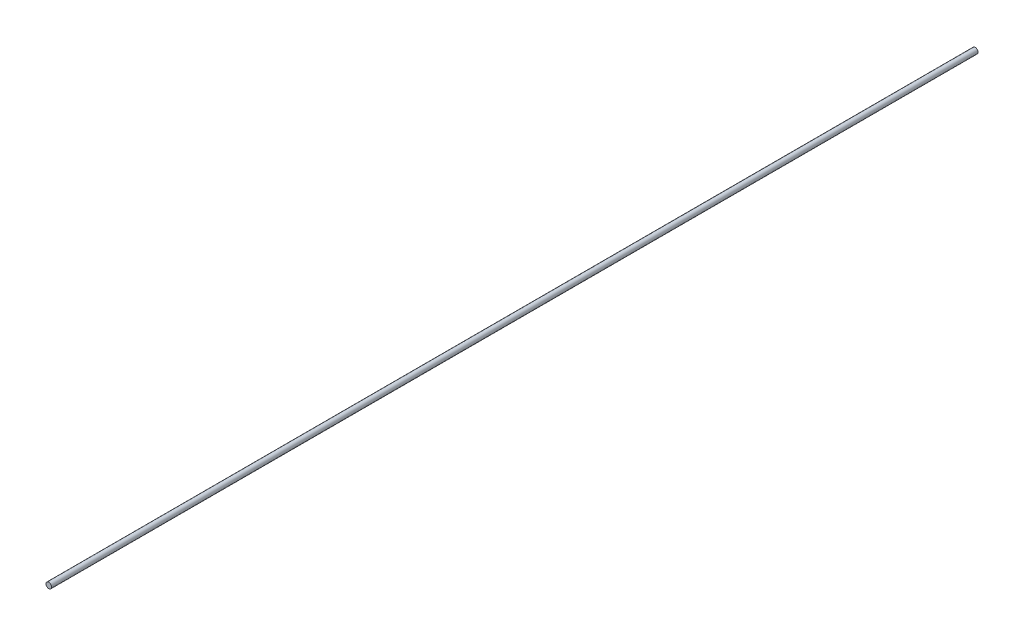
ISO-10303-21;
HEADER;
FILE_DESCRIPTION(('STEP AP214'),'2;1');
FILE_NAME('part.step','',(''),(''),'','','');
FILE_SCHEMA(('AUTOMOTIVE_DESIGN { 1 0 10303 214 1 1 1 1 }'));
ENDSEC;
DATA;
#1=APPLICATION_CONTEXT('core data for automotive mechanical design processes');
#2=APPLICATION_PROTOCOL_DEFINITION('international standard','automotive_design',2000,#1);
#3=PRODUCT_CONTEXT('',#1,'mechanical');
#4=PRODUCT('Part','Part','',(#3));
#5=PRODUCT_RELATED_PRODUCT_CATEGORY('part','',(#4));
#6=PRODUCT_DEFINITION_FORMATION('','',#4);
#7=PRODUCT_DEFINITION_CONTEXT('part definition',#1,'design');
#8=PRODUCT_DEFINITION('design','',#6,#7);
#9=PRODUCT_DEFINITION_SHAPE('','',#8);
#10=(LENGTH_UNIT() NAMED_UNIT(*) SI_UNIT(.MILLI.,.METRE.));
#11=(NAMED_UNIT(*) PLANE_ANGLE_UNIT() SI_UNIT($,.RADIAN.));
#12=(NAMED_UNIT(*) SI_UNIT($,.STERADIAN.) SOLID_ANGLE_UNIT());
#13=UNCERTAINTY_MEASURE_WITH_UNIT(LENGTH_MEASURE(1.E-05),#10,'distance_accuracy_value','');
#14=(GEOMETRIC_REPRESENTATION_CONTEXT(3) GLOBAL_UNCERTAINTY_ASSIGNED_CONTEXT((#13)) GLOBAL_UNIT_ASSIGNED_CONTEXT((#10,
#11,#12)) REPRESENTATION_CONTEXT('',''));
#15=CARTESIAN_POINT('',(0.,0.,0.));
#16=DIRECTION('',(0.,0.,1.));
#17=DIRECTION('',(1.,0.,0.));
#18=AXIS2_PLACEMENT_3D('',#15,#16,#17);
#19=CARTESIAN_POINT('',(0.,0.,160.));
#20=DIRECTION('',(0.,0.,-1.));
#21=DIRECTION('',(-1.,0.,0.));
#22=AXIS2_PLACEMENT_3D('',#19,#20,#21);
#23=CYLINDRICAL_SURFACE('',#22,0.4826);
#24=CARTESIAN_POINT('',(0.,0.,160.));
#25=DIRECTION('',(0.,0.,1.));
#26=DIRECTION('',(1.,0.,0.));
#27=AXIS2_PLACEMENT_3D('',#24,#25,#26);
#28=CIRCLE('',#27,0.4826);
#29=CARTESIAN_POINT('',(0.4826,0.,160.));
#30=VERTEX_POINT('',#29);
#31=EDGE_CURVE('E10',#30,#30,#28,.T.);
#32=ORIENTED_EDGE('',*,*,#31,.F.);
#33=EDGE_LOOP('',(#32));
#34=FACE_BOUND('',#33,.T.);
#35=CARTESIAN_POINT('',(0.,0.,0.));
#36=DIRECTION('',(0.,0.,1.));
#37=DIRECTION('',(1.,0.,0.));
#38=AXIS2_PLACEMENT_3D('',#35,#36,#37);
#39=CIRCLE('',#38,0.4826);
#40=CARTESIAN_POINT('',(0.4826,0.,0.));
#41=VERTEX_POINT('',#40);
#42=EDGE_CURVE('E34',#41,#41,#39,.T.);
#43=ORIENTED_EDGE('',*,*,#42,.T.);
#44=EDGE_LOOP('',(#43));
#45=FACE_BOUND('',#44,.T.);
#46=ADVANCED_FACE('F31',(#34,#45),#23,.T.);
#47=CARTESIAN_POINT('',(0.,0.,160.));
#48=DIRECTION('',(0.,0.,1.));
#49=DIRECTION('',(1.,0.,0.));
#50=AXIS2_PLACEMENT_3D('',#47,#48,#49);
#51=PLANE('',#50);
#52=ORIENTED_EDGE('',*,*,#31,.T.);
#53=EDGE_LOOP('',(#52));
#54=FACE_BOUND('',#53,.T.);
#55=ADVANCED_FACE('F46',(#54),#51,.T.);
#56=CARTESIAN_POINT('',(0.,0.,0.));
#57=DIRECTION('',(0.,0.,1.));
#58=DIRECTION('',(1.,0.,0.));
#59=AXIS2_PLACEMENT_3D('',#56,#57,#58);
#60=PLANE('',#59);
#61=ORIENTED_EDGE('',*,*,#42,.F.);
#62=EDGE_LOOP('',(#61));
#63=FACE_BOUND('',#62,.T.);
#64=ADVANCED_FACE('F44',(#63),#60,.F.);
#65=CLOSED_SHELL('',(#46,#55,#64));
#66=MANIFOLD_SOLID_BREP('B2',#65);
#67=ADVANCED_BREP_SHAPE_REPRESENTATION('',(#18,#66),#14);
#68=SHAPE_DEFINITION_REPRESENTATION(#9,#67);
ENDSEC;
END-ISO-10303-21;
